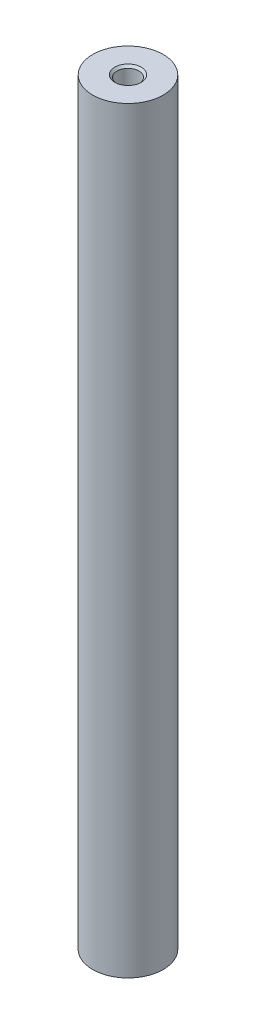
ISO-10303-21;
HEADER;
FILE_DESCRIPTION(('STEP AP214'),'2;1');
FILE_NAME('part.step','',(''),(''),'','','');
FILE_SCHEMA(('AUTOMOTIVE_DESIGN { 1 0 10303 214 1 1 1 1 }'));
ENDSEC;
DATA;
#1=APPLICATION_CONTEXT('core data for automotive mechanical design processes');
#2=APPLICATION_PROTOCOL_DEFINITION('international standard','automotive_design',2000,#1);
#3=PRODUCT_CONTEXT('',#1,'mechanical');
#4=PRODUCT('Part','Part','',(#3));
#5=PRODUCT_RELATED_PRODUCT_CATEGORY('part','',(#4));
#6=PRODUCT_DEFINITION_FORMATION('','',#4);
#7=PRODUCT_DEFINITION_CONTEXT('part definition',#1,'design');
#8=PRODUCT_DEFINITION('design','',#6,#7);
#9=PRODUCT_DEFINITION_SHAPE('','',#8);
#10=(LENGTH_UNIT() NAMED_UNIT(*) SI_UNIT(.MILLI.,.METRE.));
#11=(NAMED_UNIT(*) PLANE_ANGLE_UNIT() SI_UNIT($,.RADIAN.));
#12=(NAMED_UNIT(*) SI_UNIT($,.STERADIAN.) SOLID_ANGLE_UNIT());
#13=UNCERTAINTY_MEASURE_WITH_UNIT(LENGTH_MEASURE(1.E-05),#10,'distance_accuracy_value','');
#14=(GEOMETRIC_REPRESENTATION_CONTEXT(3) GLOBAL_UNCERTAINTY_ASSIGNED_CONTEXT((#13)) GLOBAL_UNIT_ASSIGNED_CONTEXT((#10,
#11,#12)) REPRESENTATION_CONTEXT('',''));
#15=CARTESIAN_POINT('',(0.,0.,0.));
#16=DIRECTION('',(0.,0.,1.));
#17=DIRECTION('',(1.,0.,0.));
#18=AXIS2_PLACEMENT_3D('',#15,#16,#17);
#19=CARTESIAN_POINT('',(0.,172.,0.));
#20=DIRECTION('',(0.,-1.,0.));
#21=DIRECTION('',(0.,0.,-1.));
#22=AXIS2_PLACEMENT_3D('',#19,#20,#21);
#23=CYLINDRICAL_SURFACE('',#22,8.);
#24=CARTESIAN_POINT('',(0.,172.,0.));
#25=DIRECTION('',(0.,1.,0.));
#26=DIRECTION('',(0.,0.,1.));
#27=AXIS2_PLACEMENT_3D('',#24,#25,#26);
#28=CIRCLE('',#27,8.);
#29=CARTESIAN_POINT('',(0.,172.,8.));
#30=VERTEX_POINT('',#29);
#31=EDGE_CURVE('E62',#30,#30,#28,.T.);
#32=ORIENTED_EDGE('',*,*,#31,.F.);
#33=EDGE_LOOP('',(#32));
#34=FACE_BOUND('',#33,.T.);
#35=CARTESIAN_POINT('',(0.,0.,0.));
#36=DIRECTION('',(0.,1.,0.));
#37=DIRECTION('',(0.,0.,1.));
#38=AXIS2_PLACEMENT_3D('',#35,#36,#37);
#39=CIRCLE('',#38,8.);
#40=CARTESIAN_POINT('',(0.,0.,8.));
#41=VERTEX_POINT('',#40);
#42=EDGE_CURVE('E63',#41,#41,#39,.T.);
#43=ORIENTED_EDGE('',*,*,#42,.T.);
#44=EDGE_LOOP('',(#43));
#45=FACE_BOUND('',#44,.T.);
#46=ADVANCED_FACE('F38',(#34,#45),#23,.T.);
#47=CARTESIAN_POINT('',(0.,172.,0.));
#48=DIRECTION('',(0.,1.,0.));
#49=DIRECTION('',(0.,0.,1.));
#50=AXIS2_PLACEMENT_3D('',#47,#48,#49);
#51=PLANE('',#50);
#52=CARTESIAN_POINT('',(0.,172.,0.));
#53=DIRECTION('',(0.,1.,0.));
#54=DIRECTION('',(0.,0.,1.));
#55=AXIS2_PLACEMENT_3D('',#52,#53,#54);
#56=CIRCLE('',#55,2.99999999999999);
#57=CARTESIAN_POINT('',(0.,172.,2.99999999999999));
#58=VERTEX_POINT('',#57);
#59=EDGE_CURVE('E46',#58,#58,#56,.F.);
#60=ORIENTED_EDGE('',*,*,#59,.T.);
#61=EDGE_LOOP('',(#60));
#62=FACE_BOUND('',#61,.T.);
#63=ORIENTED_EDGE('',*,*,#31,.T.);
#64=EDGE_LOOP('',(#63));
#65=FACE_BOUND('',#64,.T.);
#66=ADVANCED_FACE('F93',(#62,#65),#51,.T.);
#67=CARTESIAN_POINT('',(0.,0.,0.));
#68=DIRECTION('',(0.,1.,0.));
#69=DIRECTION('',(0.,0.,1.));
#70=AXIS2_PLACEMENT_3D('',#67,#68,#69);
#71=PLANE('',#70);
#72=CARTESIAN_POINT('',(0.,0.,0.));
#73=DIRECTION('',(0.,1.,0.));
#74=DIRECTION('',(0.,0.,1.));
#75=AXIS2_PLACEMENT_3D('',#72,#73,#74);
#76=CIRCLE('',#75,2.99999999999999);
#77=CARTESIAN_POINT('',(0.,0.,2.99999999999999));
#78=VERTEX_POINT('',#77);
#79=EDGE_CURVE('E51',#78,#78,#76,.T.);
#80=ORIENTED_EDGE('',*,*,#79,.T.);
#81=EDGE_LOOP('',(#80));
#82=FACE_BOUND('',#81,.T.);
#83=ORIENTED_EDGE('',*,*,#42,.F.);
#84=EDGE_LOOP('',(#83));
#85=FACE_BOUND('',#84,.T.);
#86=ADVANCED_FACE('F100',(#82,#85),#71,.F.);
#87=CARTESIAN_POINT('',(0.,15.,0.));
#88=DIRECTION('',(0.,-1.,0.));
#89=DIRECTION('',(0.,0.,-1.));
#90=AXIS2_PLACEMENT_3D('',#87,#88,#89);
#91=CYLINDRICAL_SURFACE('',#90,2.5);
#92=CARTESIAN_POINT('',(0.,0.499999999999983,0.));
#93=DIRECTION('',(0.,1.,0.));
#94=DIRECTION('',(0.,0.,1.));
#95=AXIS2_PLACEMENT_3D('',#92,#93,#94);
#96=CIRCLE('',#95,2.5);
#97=CARTESIAN_POINT('',(0.,0.499999999999983,2.5));
#98=VERTEX_POINT('',#97);
#99=EDGE_CURVE('E56',#98,#98,#96,.F.);
#100=ORIENTED_EDGE('',*,*,#99,.T.);
#101=EDGE_LOOP('',(#100));
#102=FACE_BOUND('',#101,.T.);
#103=CARTESIAN_POINT('',(0.,15.,0.));
#104=DIRECTION('',(0.,-1.,0.));
#105=DIRECTION('',(0.,0.,-1.));
#106=AXIS2_PLACEMENT_3D('',#103,#104,#105);
#107=CIRCLE('',#106,2.5);
#108=CARTESIAN_POINT('',(0.,15.,-2.5));
#109=VERTEX_POINT('',#108);
#110=EDGE_CURVE('E67',#109,#109,#107,.T.);
#111=ORIENTED_EDGE('',*,*,#110,.F.);
#112=EDGE_LOOP('',(#111));
#113=FACE_BOUND('',#112,.T.);
#114=ADVANCED_FACE('F106',(#102,#113),#91,.F.);
#115=CARTESIAN_POINT('',(0.,15.,0.));
#116=DIRECTION('',(0.,-1.,0.));
#117=DIRECTION('',(0.,0.,-1.));
#118=AXIS2_PLACEMENT_3D('',#115,#116,#117);
#119=PLANE('',#118);
#120=ORIENTED_EDGE('',*,*,#110,.T.);
#121=EDGE_LOOP('',(#120));
#122=FACE_BOUND('',#121,.T.);
#123=ADVANCED_FACE('F90',(#122),#119,.T.);
#124=CARTESIAN_POINT('',(0.,157.,0.));
#125=DIRECTION('',(0.,1.,0.));
#126=DIRECTION('',(0.,0.,1.));
#127=AXIS2_PLACEMENT_3D('',#124,#125,#126);
#128=CYLINDRICAL_SURFACE('',#127,2.5);
#129=CARTESIAN_POINT('',(0.,171.5,0.));
#130=DIRECTION('',(0.,1.,0.));
#131=DIRECTION('',(0.,0.,1.));
#132=AXIS2_PLACEMENT_3D('',#129,#130,#131);
#133=CIRCLE('',#132,2.5);
#134=CARTESIAN_POINT('',(0.,171.5,2.5));
#135=VERTEX_POINT('',#134);
#136=EDGE_CURVE('E10',#135,#135,#133,.T.);
#137=ORIENTED_EDGE('',*,*,#136,.T.);
#138=EDGE_LOOP('',(#137));
#139=FACE_BOUND('',#138,.T.);
#140=CARTESIAN_POINT('',(0.,157.,0.));
#141=DIRECTION('',(0.,-1.,0.));
#142=DIRECTION('',(0.,0.,-1.));
#143=AXIS2_PLACEMENT_3D('',#140,#141,#142);
#144=CIRCLE('',#143,2.5);
#145=CARTESIAN_POINT('',(0.,157.,-2.5));
#146=VERTEX_POINT('',#145);
#147=EDGE_CURVE('E74',#146,#146,#144,.T.);
#148=ORIENTED_EDGE('',*,*,#147,.T.);
#149=EDGE_LOOP('',(#148));
#150=FACE_BOUND('',#149,.T.);
#151=ADVANCED_FACE('F79',(#139,#150),#128,.F.);
#152=CARTESIAN_POINT('',(0.,157.,0.));
#153=DIRECTION('',(0.,1.,0.));
#154=DIRECTION('',(0.,0.,-1.));
#155=AXIS2_PLACEMENT_3D('',#152,#153,#154);
#156=PLANE('',#155);
#157=ORIENTED_EDGE('',*,*,#147,.F.);
#158=EDGE_LOOP('',(#157));
#159=FACE_BOUND('',#158,.T.);
#160=ADVANCED_FACE('F81',(#159),#156,.T.);
#161=CARTESIAN_POINT('',(0.,0.499999999999983,0.));
#162=DIRECTION('',(0.,-1.,0.));
#163=DIRECTION('',(0.,0.,-1.));
#164=AXIS2_PLACEMENT_3D('',#161,#162,#163);
#165=CONICAL_SURFACE('',#164,2.5,0.785398163397454);
#166=ORIENTED_EDGE('',*,*,#79,.F.);
#167=EDGE_LOOP('',(#166));
#168=FACE_BOUND('',#167,.T.);
#169=ORIENTED_EDGE('',*,*,#99,.F.);
#170=EDGE_LOOP('',(#169));
#171=FACE_BOUND('',#170,.T.);
#172=ADVANCED_FACE('F83',(#168,#171),#165,.F.);
#173=CARTESIAN_POINT('',(0.,172.,0.));
#174=DIRECTION('',(0.,1.,0.));
#175=DIRECTION('',(0.,0.,1.));
#176=AXIS2_PLACEMENT_3D('',#173,#174,#175);
#177=CONICAL_SURFACE('',#176,2.99999999999999,0.785398163397437);
#178=ORIENTED_EDGE('',*,*,#136,.F.);
#179=EDGE_LOOP('',(#178));
#180=FACE_BOUND('',#179,.T.);
#181=ORIENTED_EDGE('',*,*,#59,.F.);
#182=EDGE_LOOP('',(#181));
#183=FACE_BOUND('',#182,.T.);
#184=ADVANCED_FACE('F40',(#180,#183),#177,.F.);
#185=CLOSED_SHELL('',(#46,#66,#86,#114,#123,#151,#160,#172,#184));
#186=MANIFOLD_SOLID_BREP('B2',#185);
#187=ADVANCED_BREP_SHAPE_REPRESENTATION('',(#18,#186),#14);
#188=SHAPE_DEFINITION_REPRESENTATION(#9,#187);
ENDSEC;
END-ISO-10303-21;
